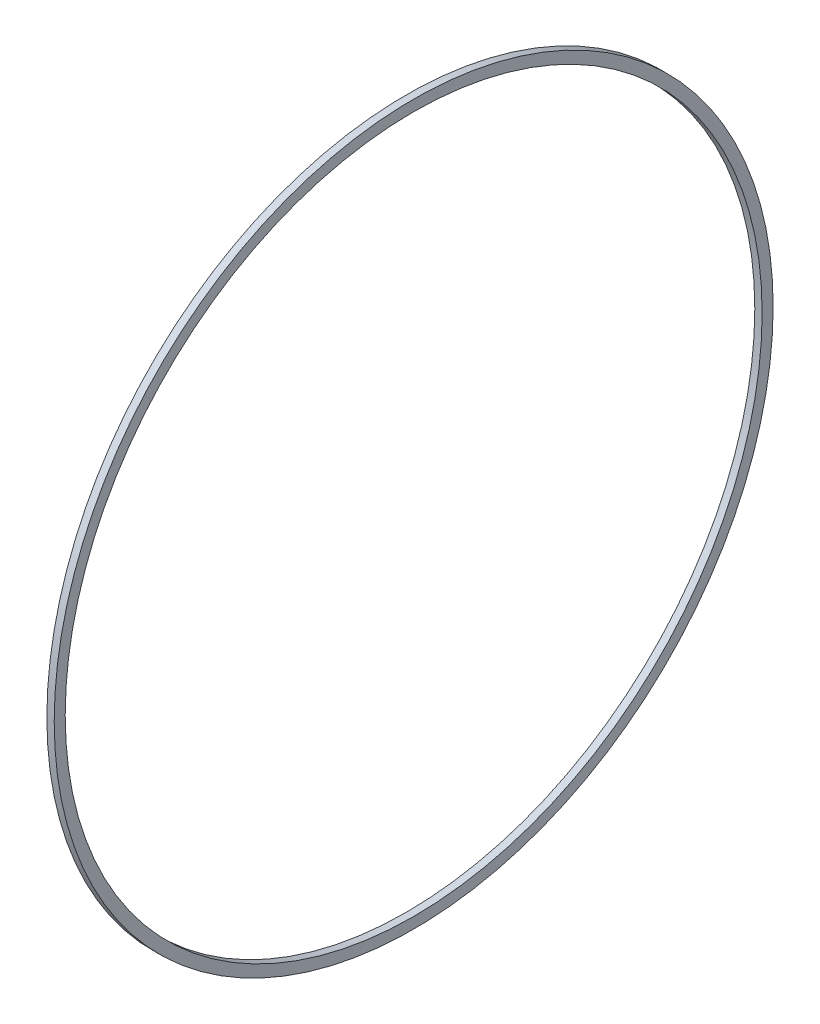
ISO-10303-21;
HEADER;
FILE_DESCRIPTION(('STEP AP214'),'2;1');
FILE_NAME('part.step','',(''),(''),'','','');
FILE_SCHEMA(('AUTOMOTIVE_DESIGN { 1 0 10303 214 1 1 1 1 }'));
ENDSEC;
DATA;
#1=APPLICATION_CONTEXT('core data for automotive mechanical design processes');
#2=APPLICATION_PROTOCOL_DEFINITION('international standard','automotive_design',2000,#1);
#3=PRODUCT_CONTEXT('',#1,'mechanical');
#4=PRODUCT('Part','Part','',(#3));
#5=PRODUCT_RELATED_PRODUCT_CATEGORY('part','',(#4));
#6=PRODUCT_DEFINITION_FORMATION('','',#4);
#7=PRODUCT_DEFINITION_CONTEXT('part definition',#1,'design');
#8=PRODUCT_DEFINITION('design','',#6,#7);
#9=PRODUCT_DEFINITION_SHAPE('','',#8);
#10=(LENGTH_UNIT() NAMED_UNIT(*) SI_UNIT(.MILLI.,.METRE.));
#11=(NAMED_UNIT(*) PLANE_ANGLE_UNIT() SI_UNIT($,.RADIAN.));
#12=(NAMED_UNIT(*) SI_UNIT($,.STERADIAN.) SOLID_ANGLE_UNIT());
#13=UNCERTAINTY_MEASURE_WITH_UNIT(LENGTH_MEASURE(1.E-05),#10,'distance_accuracy_value','');
#14=(GEOMETRIC_REPRESENTATION_CONTEXT(3) GLOBAL_UNCERTAINTY_ASSIGNED_CONTEXT((#13)) GLOBAL_UNIT_ASSIGNED_CONTEXT((#10,
#11,#12)) REPRESENTATION_CONTEXT('',''));
#15=CARTESIAN_POINT('',(0.,0.,0.));
#16=DIRECTION('',(0.,0.,1.));
#17=DIRECTION('',(1.,0.,0.));
#18=AXIS2_PLACEMENT_3D('',#15,#16,#17);
#19=CARTESIAN_POINT('',(1.,0.,0.));
#20=DIRECTION('',(1.,0.,0.));
#21=DIRECTION('',(0.,0.,-1.));
#22=AXIS2_PLACEMENT_3D('',#19,#20,#21);
#23=PLANE('',#22);
#24=CARTESIAN_POINT('',(1.,0.,0.));
#25=DIRECTION('',(1.,0.,0.));
#26=DIRECTION('',(0.,0.,-1.));
#27=AXIS2_PLACEMENT_3D('',#24,#25,#26);
#28=CIRCLE('',#27,49.);
#29=CARTESIAN_POINT('',(1.,0.,-49.));
#30=VERTEX_POINT('',#29);
#31=EDGE_CURVE('E10',#30,#30,#28,.T.);
#32=ORIENTED_EDGE('',*,*,#31,.T.);
#33=EDGE_LOOP('',(#32));
#34=FACE_BOUND('',#33,.T.);
#35=CARTESIAN_POINT('',(1.,0.,0.));
#36=DIRECTION('',(1.,0.,0.));
#37=DIRECTION('',(0.,0.,-1.));
#38=AXIS2_PLACEMENT_3D('',#35,#36,#37);
#39=CIRCLE('',#38,47.5);
#40=CARTESIAN_POINT('',(1.,0.,-47.5));
#41=VERTEX_POINT('',#40);
#42=EDGE_CURVE('E50',#41,#41,#39,.T.);
#43=ORIENTED_EDGE('',*,*,#42,.F.);
#44=EDGE_LOOP('',(#43));
#45=FACE_BOUND('',#44,.T.);
#46=ADVANCED_FACE('F37',(#34,#45),#23,.T.);
#47=CARTESIAN_POINT('',(0.,0.,0.));
#48=DIRECTION('',(1.,0.,0.));
#49=DIRECTION('',(0.,0.,-1.));
#50=AXIS2_PLACEMENT_3D('',#47,#48,#49);
#51=PLANE('',#50);
#52=CARTESIAN_POINT('',(0.,0.,0.));
#53=DIRECTION('',(1.,0.,0.));
#54=DIRECTION('',(0.,0.,-1.));
#55=AXIS2_PLACEMENT_3D('',#52,#53,#54);
#56=CIRCLE('',#55,49.);
#57=CARTESIAN_POINT('',(0.,0.,-49.));
#58=VERTEX_POINT('',#57);
#59=EDGE_CURVE('E41',#58,#58,#56,.T.);
#60=ORIENTED_EDGE('',*,*,#59,.F.);
#61=EDGE_LOOP('',(#60));
#62=FACE_BOUND('',#61,.T.);
#63=CARTESIAN_POINT('',(0.,0.,0.));
#64=DIRECTION('',(1.,0.,0.));
#65=DIRECTION('',(0.,0.,-1.));
#66=AXIS2_PLACEMENT_3D('',#63,#64,#65);
#67=CIRCLE('',#66,47.5);
#68=CARTESIAN_POINT('',(0.,0.,-47.5));
#69=VERTEX_POINT('',#68);
#70=EDGE_CURVE('E52',#69,#69,#67,.T.);
#71=ORIENTED_EDGE('',*,*,#70,.T.);
#72=EDGE_LOOP('',(#71));
#73=FACE_BOUND('',#72,.T.);
#74=ADVANCED_FACE('F64',(#62,#73),#51,.F.);
#75=CARTESIAN_POINT('',(1.,0.,0.));
#76=DIRECTION('',(-1.,0.,0.));
#77=DIRECTION('',(0.,0.,1.));
#78=AXIS2_PLACEMENT_3D('',#75,#76,#77);
#79=CYLINDRICAL_SURFACE('',#78,49.);
#80=ORIENTED_EDGE('',*,*,#31,.F.);
#81=EDGE_LOOP('',(#80));
#82=FACE_BOUND('',#81,.T.);
#83=ORIENTED_EDGE('',*,*,#59,.T.);
#84=EDGE_LOOP('',(#83));
#85=FACE_BOUND('',#84,.T.);
#86=ADVANCED_FACE('F39',(#82,#85),#79,.T.);
#87=CARTESIAN_POINT('',(1.,0.,0.));
#88=DIRECTION('',(-1.,0.,0.));
#89=DIRECTION('',(0.,0.,1.));
#90=AXIS2_PLACEMENT_3D('',#87,#88,#89);
#91=CYLINDRICAL_SURFACE('',#90,47.5);
#92=ORIENTED_EDGE('',*,*,#42,.T.);
#93=EDGE_LOOP('',(#92));
#94=FACE_BOUND('',#93,.T.);
#95=ORIENTED_EDGE('',*,*,#70,.F.);
#96=EDGE_LOOP('',(#95));
#97=FACE_BOUND('',#96,.T.);
#98=ADVANCED_FACE('F60',(#94,#97),#91,.F.);
#99=CLOSED_SHELL('',(#46,#74,#86,#98));
#100=MANIFOLD_SOLID_BREP('B2',#99);
#101=ADVANCED_BREP_SHAPE_REPRESENTATION('',(#18,#100),#14);
#102=SHAPE_DEFINITION_REPRESENTATION(#9,#101);
ENDSEC;
END-ISO-10303-21;
